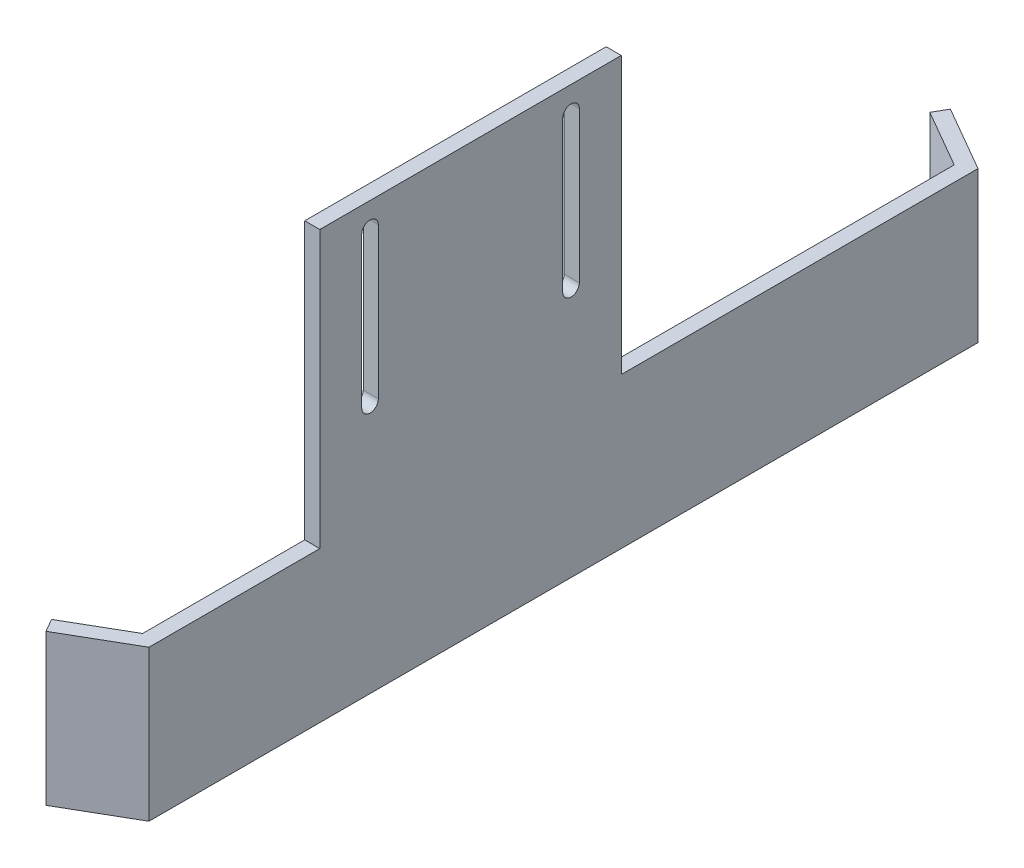
ISO-10303-21;
HEADER;
FILE_DESCRIPTION(('STEP AP214'),'2;1');
FILE_NAME('part.step','',(''),(''),'','','');
FILE_SCHEMA(('AUTOMOTIVE_DESIGN { 1 0 10303 214 1 1 1 1 }'));
ENDSEC;
DATA;
#1=APPLICATION_CONTEXT('core data for automotive mechanical design processes');
#2=APPLICATION_PROTOCOL_DEFINITION('international standard','automotive_design',2000,#1);
#3=PRODUCT_CONTEXT('',#1,'mechanical');
#4=PRODUCT('Part','Part','',(#3));
#5=PRODUCT_RELATED_PRODUCT_CATEGORY('part','',(#4));
#6=PRODUCT_DEFINITION_FORMATION('','',#4);
#7=PRODUCT_DEFINITION_CONTEXT('part definition',#1,'design');
#8=PRODUCT_DEFINITION('design','',#6,#7);
#9=PRODUCT_DEFINITION_SHAPE('','',#8);
#10=(LENGTH_UNIT() NAMED_UNIT(*) SI_UNIT(.MILLI.,.METRE.));
#11=(NAMED_UNIT(*) PLANE_ANGLE_UNIT() SI_UNIT($,.RADIAN.));
#12=(NAMED_UNIT(*) SI_UNIT($,.STERADIAN.) SOLID_ANGLE_UNIT());
#13=UNCERTAINTY_MEASURE_WITH_UNIT(LENGTH_MEASURE(1.E-05),#10,'distance_accuracy_value','');
#14=(GEOMETRIC_REPRESENTATION_CONTEXT(3) GLOBAL_UNCERTAINTY_ASSIGNED_CONTEXT((#13)) GLOBAL_UNIT_ASSIGNED_CONTEXT((#10,
#11,#12)) REPRESENTATION_CONTEXT('',''));
#15=CARTESIAN_POINT('',(0.,0.,0.));
#16=DIRECTION('',(0.,0.,1.));
#17=DIRECTION('',(1.,0.,0.));
#18=AXIS2_PLACEMENT_3D('',#15,#16,#17);
#19=CARTESIAN_POINT('',(82.,0.,0.));
#20=DIRECTION('',(1.,0.,0.));
#21=DIRECTION('',(0.,0.,-1.));
#22=AXIS2_PLACEMENT_3D('',#19,#20,#21);
#23=PLANE('',#22);
#24=DIRECTION('',(0.,-1.,0.));
#25=VECTOR('',#24,1.);
#26=CARTESIAN_POINT('',(82.,-25.,-97.7679491924311));
#27=LINE('',#26,#25);
#28=CARTESIAN_POINT('',(82.,-25.,-97.7679491924311));
#29=VERTEX_POINT('',#28);
#30=CARTESIAN_POINT('',(82.,-55.,-97.7679491924311));
#31=VERTEX_POINT('',#30);
#32=EDGE_CURVE('E263',#29,#31,#27,.T.);
#33=ORIENTED_EDGE('',*,*,#32,.T.);
#34=DIRECTION('',(0.,0.,-1.));
#35=VECTOR('',#34,1.);
#36=CARTESIAN_POINT('',(82.,-55.,65.5));
#37=LINE('',#36,#35);
#38=CARTESIAN_POINT('',(82.,-55.,63.7679491924312));
#39=VERTEX_POINT('',#38);
#40=EDGE_CURVE('E315',#39,#31,#37,.T.);
#41=ORIENTED_EDGE('',*,*,#40,.F.);
#42=DIRECTION('',(0.,-1.,0.));
#43=VECTOR('',#42,1.);
#44=CARTESIAN_POINT('',(82.,-25.,63.7679491924312));
#45=LINE('',#44,#43);
#46=CARTESIAN_POINT('',(82.,-25.,63.7679491924312));
#47=VERTEX_POINT('',#46);
#48=EDGE_CURVE('E285',#47,#39,#45,.T.);
#49=ORIENTED_EDGE('',*,*,#48,.F.);
#50=DIRECTION('',(0.,0.,1.));
#51=VECTOR('',#50,1.);
#52=CARTESIAN_POINT('',(82.,-25.,31.5));
#53=LINE('',#52,#51);
#54=CARTESIAN_POINT('',(82.,-25.,31.5));
#55=VERTEX_POINT('',#54);
#56=EDGE_CURVE('E288',#55,#47,#53,.T.);
#57=ORIENTED_EDGE('',*,*,#56,.F.);
#58=DIRECTION('',(0.,-1.,0.));
#59=VECTOR('',#58,1.);
#60=CARTESIAN_POINT('',(82.,9.99999999999999,31.5));
#61=LINE('',#60,#59);
#62=CARTESIAN_POINT('',(82.,30.,31.5000000000001));
#63=VERTEX_POINT('',#62);
#64=EDGE_CURVE('E307',#63,#55,#61,.T.);
#65=ORIENTED_EDGE('',*,*,#64,.F.);
#66=DIRECTION('',(0.,0.,-1.));
#67=VECTOR('',#66,1.);
#68=CARTESIAN_POINT('',(82.,30.,-28.5));
#69=LINE('',#68,#67);
#70=CARTESIAN_POINT('',(82.,30.,-28.5));
#71=VERTEX_POINT('',#70);
#72=EDGE_CURVE('E204',#63,#71,#69,.T.);
#73=ORIENTED_EDGE('',*,*,#72,.T.);
#74=DIRECTION('',(0.,1.,0.));
#75=VECTOR('',#74,1.);
#76=CARTESIAN_POINT('',(82.,9.99999999999999,-28.5));
#77=LINE('',#76,#75);
#78=CARTESIAN_POINT('',(82.,-25.,-28.5));
#79=VERTEX_POINT('',#78);
#80=EDGE_CURVE('E292',#79,#71,#77,.T.);
#81=ORIENTED_EDGE('',*,*,#80,.F.);
#82=DIRECTION('',(0.,0.,1.));
#83=VECTOR('',#82,1.);
#84=CARTESIAN_POINT('',(82.,-25.,-99.5));
#85=LINE('',#84,#83);
#86=EDGE_CURVE('E294',#29,#79,#85,.T.);
#87=ORIENTED_EDGE('',*,*,#86,.F.);
#88=EDGE_LOOP('',(#33,#41,#49,#57,#65,#73,#81,#87));
#89=FACE_BOUND('',#88,.T.);
#90=DIRECTION('',(0.,1.,0.));
#91=VECTOR('',#90,1.);
#92=CARTESIAN_POINT('',(82.,-5.,23.1500000000001));
#93=LINE('',#92,#91);
#94=CARTESIAN_POINT('',(82.,-5.,23.1500000000001));
#95=VERTEX_POINT('',#94);
#96=CARTESIAN_POINT('',(82.,25.,23.1500000000001));
#97=VERTEX_POINT('',#96);
#98=EDGE_CURVE('E56',#95,#97,#93,.T.);
#99=ORIENTED_EDGE('',*,*,#98,.F.);
#100=CARTESIAN_POINT('',(82.,-5.,21.5000000000001));
#101=DIRECTION('',(-1.,0.,0.));
#102=DIRECTION('',(0.,0.,1.));
#103=AXIS2_PLACEMENT_3D('',#100,#101,#102);
#104=CIRCLE('',#103,1.65);
#105=CARTESIAN_POINT('',(82.,-5.,19.8500000000001));
#106=VERTEX_POINT('',#105);
#107=EDGE_CURVE('E216',#106,#95,#104,.T.);
#108=ORIENTED_EDGE('',*,*,#107,.F.);
#109=DIRECTION('',(0.,-1.,0.));
#110=VECTOR('',#109,1.);
#111=CARTESIAN_POINT('',(82.,-5.,19.8500000000001));
#112=LINE('',#111,#110);
#113=CARTESIAN_POINT('',(82.,25.,19.8500000000001));
#114=VERTEX_POINT('',#113);
#115=EDGE_CURVE('E212',#114,#106,#112,.T.);
#116=ORIENTED_EDGE('',*,*,#115,.F.);
#117=CARTESIAN_POINT('',(82.,25.,21.5000000000001));
#118=DIRECTION('',(-1.,0.,0.));
#119=DIRECTION('',(0.,0.,1.));
#120=AXIS2_PLACEMENT_3D('',#117,#118,#119);
#121=CIRCLE('',#120,1.65);
#122=EDGE_CURVE('E219',#97,#114,#121,.T.);
#123=ORIENTED_EDGE('',*,*,#122,.F.);
#124=EDGE_LOOP('',(#99,#108,#116,#123));
#125=FACE_BOUND('',#124,.T.);
#126=DIRECTION('',(0.,1.,0.));
#127=VECTOR('',#126,1.);
#128=CARTESIAN_POINT('',(82.,-5.,-16.85));
#129=LINE('',#128,#127);
#130=CARTESIAN_POINT('',(82.,-5.,-16.85));
#131=VERTEX_POINT('',#130);
#132=CARTESIAN_POINT('',(82.,25.,-16.85));
#133=VERTEX_POINT('',#132);
#134=EDGE_CURVE('E48',#131,#133,#129,.T.);
#135=ORIENTED_EDGE('',*,*,#134,.F.);
#136=CARTESIAN_POINT('',(82.,-5.,-18.5));
#137=DIRECTION('',(-1.,0.,0.));
#138=DIRECTION('',(0.,0.,1.));
#139=AXIS2_PLACEMENT_3D('',#136,#137,#138);
#140=CIRCLE('',#139,1.65);
#141=CARTESIAN_POINT('',(82.,-5.,-20.15));
#142=VERTEX_POINT('',#141);
#143=EDGE_CURVE('E187',#142,#131,#140,.T.);
#144=ORIENTED_EDGE('',*,*,#143,.F.);
#145=DIRECTION('',(0.,-1.,0.));
#146=VECTOR('',#145,1.);
#147=CARTESIAN_POINT('',(82.,-5.,-20.15));
#148=LINE('',#147,#146);
#149=CARTESIAN_POINT('',(82.,25.,-20.15));
#150=VERTEX_POINT('',#149);
#151=EDGE_CURVE('E191',#150,#142,#148,.T.);
#152=ORIENTED_EDGE('',*,*,#151,.F.);
#153=CARTESIAN_POINT('',(82.,25.,-18.5));
#154=DIRECTION('',(-1.,0.,0.));
#155=DIRECTION('',(0.,0.,1.));
#156=AXIS2_PLACEMENT_3D('',#153,#154,#155);
#157=CIRCLE('',#156,1.65);
#158=EDGE_CURVE('E194',#133,#150,#157,.T.);
#159=ORIENTED_EDGE('',*,*,#158,.F.);
#160=EDGE_LOOP('',(#135,#144,#152,#159));
#161=FACE_BOUND('',#160,.T.);
#162=ADVANCED_FACE('F33',(#89,#125,#161),#23,.F.);
#163=CARTESIAN_POINT('',(85.,0.,3.));
#164=DIRECTION('',(-1.,0.,0.));
#165=DIRECTION('',(0.,0.,1.));
#166=AXIS2_PLACEMENT_3D('',#163,#164,#165);
#167=PLANE('',#166);
#168=CARTESIAN_POINT('',(85.,25.,21.5000000000001));
#169=DIRECTION('',(-1.,0.,0.));
#170=DIRECTION('',(0.,0.,1.));
#171=AXIS2_PLACEMENT_3D('',#168,#169,#170);
#172=CIRCLE('',#171,1.65);
#173=CARTESIAN_POINT('',(85.,25.,23.1500000000001));
#174=VERTEX_POINT('',#173);
#175=CARTESIAN_POINT('',(85.,25.,19.8500000000001));
#176=VERTEX_POINT('',#175);
#177=EDGE_CURVE('E211',#174,#176,#172,.T.);
#178=ORIENTED_EDGE('',*,*,#177,.T.);
#179=DIRECTION('',(0.,-1.,0.));
#180=VECTOR('',#179,1.);
#181=CARTESIAN_POINT('',(85.,0.,19.8500000000001));
#182=LINE('',#181,#180);
#183=CARTESIAN_POINT('',(85.,-5.,19.8500000000001));
#184=VERTEX_POINT('',#183);
#185=EDGE_CURVE('E181',#176,#184,#182,.T.);
#186=ORIENTED_EDGE('',*,*,#185,.T.);
#187=CARTESIAN_POINT('',(85.,-5.,21.5000000000001));
#188=DIRECTION('',(-1.,0.,0.));
#189=DIRECTION('',(0.,0.,1.));
#190=AXIS2_PLACEMENT_3D('',#187,#188,#189);
#191=CIRCLE('',#190,1.65);
#192=CARTESIAN_POINT('',(85.,-5.,23.1500000000001));
#193=VERTEX_POINT('',#192);
#194=EDGE_CURVE('E208',#184,#193,#191,.T.);
#195=ORIENTED_EDGE('',*,*,#194,.T.);
#196=DIRECTION('',(0.,1.,0.));
#197=VECTOR('',#196,1.);
#198=CARTESIAN_POINT('',(85.,0.,23.1500000000001));
#199=LINE('',#198,#197);
#200=EDGE_CURVE('E317',#193,#174,#199,.T.);
#201=ORIENTED_EDGE('',*,*,#200,.T.);
#202=EDGE_LOOP('',(#178,#186,#195,#201));
#203=FACE_BOUND('',#202,.T.);
#204=CARTESIAN_POINT('',(85.,25.,-18.5));
#205=DIRECTION('',(-1.,0.,0.));
#206=DIRECTION('',(0.,0.,1.));
#207=AXIS2_PLACEMENT_3D('',#204,#205,#206);
#208=CIRCLE('',#207,1.65);
#209=CARTESIAN_POINT('',(85.,25.,-16.85));
#210=VERTEX_POINT('',#209);
#211=CARTESIAN_POINT('',(85.,25.,-20.15));
#212=VERTEX_POINT('',#211);
#213=EDGE_CURVE('E188',#210,#212,#208,.T.);
#214=ORIENTED_EDGE('',*,*,#213,.T.);
#215=DIRECTION('',(0.,-1.,0.));
#216=VECTOR('',#215,1.);
#217=CARTESIAN_POINT('',(85.,0.,-20.15));
#218=LINE('',#217,#216);
#219=CARTESIAN_POINT('',(85.,-5.,-20.15));
#220=VERTEX_POINT('',#219);
#221=EDGE_CURVE('E11',#212,#220,#218,.T.);
#222=ORIENTED_EDGE('',*,*,#221,.T.);
#223=CARTESIAN_POINT('',(85.,-5.,-18.5));
#224=DIRECTION('',(-1.,0.,0.));
#225=DIRECTION('',(0.,0.,1.));
#226=AXIS2_PLACEMENT_3D('',#223,#224,#225);
#227=CIRCLE('',#226,1.65);
#228=CARTESIAN_POINT('',(85.,-5.,-16.85));
#229=VERTEX_POINT('',#228);
#230=EDGE_CURVE('E186',#220,#229,#227,.T.);
#231=ORIENTED_EDGE('',*,*,#230,.T.);
#232=DIRECTION('',(0.,1.,0.));
#233=VECTOR('',#232,1.);
#234=CARTESIAN_POINT('',(85.,0.,-16.85));
#235=LINE('',#234,#233);
#236=EDGE_CURVE('E41',#229,#210,#235,.T.);
#237=ORIENTED_EDGE('',*,*,#236,.T.);
#238=EDGE_LOOP('',(#214,#222,#231,#237));
#239=FACE_BOUND('',#238,.T.);
#240=DIRECTION('',(0.,1.,0.));
#241=VECTOR('',#240,1.);
#242=CARTESIAN_POINT('',(85.,10.,-99.5));
#243=LINE('',#242,#241);
#244=CARTESIAN_POINT('',(85.,-55.,-99.5));
#245=VERTEX_POINT('',#244);
#246=CARTESIAN_POINT('',(85.,-25.,-99.5));
#247=VERTEX_POINT('',#246);
#248=EDGE_CURVE('E318',#245,#247,#243,.T.);
#249=ORIENTED_EDGE('',*,*,#248,.T.);
#250=DIRECTION('',(0.,0.,-1.));
#251=VECTOR('',#250,1.);
#252=CARTESIAN_POINT('',(85.,-25.,-99.5));
#253=LINE('',#252,#251);
#254=CARTESIAN_POINT('',(85.,-25.,-28.5));
#255=VERTEX_POINT('',#254);
#256=EDGE_CURVE('E300',#255,#247,#253,.T.);
#257=ORIENTED_EDGE('',*,*,#256,.F.);
#258=DIRECTION('',(0.,-1.,0.));
#259=VECTOR('',#258,1.);
#260=CARTESIAN_POINT('',(85.,9.99999999999999,-28.5));
#261=LINE('',#260,#259);
#262=CARTESIAN_POINT('',(85.,30.,-28.5));
#263=VERTEX_POINT('',#262);
#264=EDGE_CURVE('E297',#263,#255,#261,.T.);
#265=ORIENTED_EDGE('',*,*,#264,.F.);
#266=DIRECTION('',(0.,0.,-1.));
#267=VECTOR('',#266,1.);
#268=CARTESIAN_POINT('',(85.,30.,-28.5));
#269=LINE('',#268,#267);
#270=CARTESIAN_POINT('',(85.,30.,31.5000000000001));
#271=VERTEX_POINT('',#270);
#272=EDGE_CURVE('E232',#271,#263,#269,.T.);
#273=ORIENTED_EDGE('',*,*,#272,.F.);
#274=DIRECTION('',(0.,1.,0.));
#275=VECTOR('',#274,1.);
#276=CARTESIAN_POINT('',(85.,9.99999999999999,31.5));
#277=LINE('',#276,#275);
#278=CARTESIAN_POINT('',(85.,-25.,31.5));
#279=VERTEX_POINT('',#278);
#280=EDGE_CURVE('E309',#279,#271,#277,.T.);
#281=ORIENTED_EDGE('',*,*,#280,.F.);
#282=DIRECTION('',(0.,0.,-1.));
#283=VECTOR('',#282,1.);
#284=CARTESIAN_POINT('',(85.,-25.,31.5));
#285=LINE('',#284,#283);
#286=CARTESIAN_POINT('',(85.,-25.,65.5));
#287=VERTEX_POINT('',#286);
#288=EDGE_CURVE('E311',#287,#279,#285,.T.);
#289=ORIENTED_EDGE('',*,*,#288,.F.);
#290=DIRECTION('',(0.,-1.,0.));
#291=VECTOR('',#290,1.);
#292=CARTESIAN_POINT('',(85.,10.,65.5));
#293=LINE('',#292,#291);
#294=CARTESIAN_POINT('',(85.,-55.,65.5));
#295=VERTEX_POINT('',#294);
#296=EDGE_CURVE('E305',#287,#295,#293,.T.);
#297=ORIENTED_EDGE('',*,*,#296,.T.);
#298=DIRECTION('',(0.,0.,-1.));
#299=VECTOR('',#298,1.);
#300=CARTESIAN_POINT('',(85.,-55.,65.5));
#301=LINE('',#300,#299);
#302=EDGE_CURVE('E321',#295,#245,#301,.T.);
#303=ORIENTED_EDGE('',*,*,#302,.T.);
#304=EDGE_LOOP('',(#249,#257,#265,#273,#281,#289,#297,#303));
#305=FACE_BOUND('',#304,.T.);
#306=ADVANCED_FACE('F35',(#203,#239,#305),#167,.F.);
#307=CARTESIAN_POINT('',(82.,-55.,65.5));
#308=DIRECTION('',(0.,-1.,0.));
#309=DIRECTION('',(0.,0.,-1.));
#310=AXIS2_PLACEMENT_3D('',#307,#308,#309);
#311=PLANE('',#310);
#312=ORIENTED_EDGE('',*,*,#40,.T.);
#313=DIRECTION('',(-0.866025403784436,0.,-0.500000000000004));
#314=VECTOR('',#313,1.);
#315=CARTESIAN_POINT('',(70.5096189432335,-55.,-104.401923788647));
#316=LINE('',#315,#314);
#317=CARTESIAN_POINT('',(70.5096189432335,-55.,-104.401923788647));
#318=VERTEX_POINT('',#317);
#319=EDGE_CURVE('E248',#31,#318,#316,.T.);
#320=ORIENTED_EDGE('',*,*,#319,.T.);
#321=DIRECTION('',(0.499999999999998,0.,-0.866025403784439));
#322=VECTOR('',#321,1.);
#323=CARTESIAN_POINT('',(72.0096189432335,-55.,-107.));
#324=LINE('',#323,#322);
#325=CARTESIAN_POINT('',(72.0096189432335,-55.,-107.));
#326=VERTEX_POINT('',#325);
#327=EDGE_CURVE('E241',#318,#326,#324,.T.);
#328=ORIENTED_EDGE('',*,*,#327,.T.);
#329=DIRECTION('',(0.866025403784436,0.,0.500000000000005));
#330=VECTOR('',#329,1.);
#331=CARTESIAN_POINT('',(85.,-55.,-99.5));
#332=LINE('',#331,#330);
#333=EDGE_CURVE('E256',#326,#245,#332,.T.);
#334=ORIENTED_EDGE('',*,*,#333,.T.);
#335=ORIENTED_EDGE('',*,*,#302,.F.);
#336=DIRECTION('',(-0.866025403784436,0.,0.500000000000004));
#337=VECTOR('',#336,1.);
#338=CARTESIAN_POINT('',(85.,-55.,65.5));
#339=LINE('',#338,#337);
#340=CARTESIAN_POINT('',(72.0096189432335,-55.,73.0000000000001));
#341=VERTEX_POINT('',#340);
#342=EDGE_CURVE('E262',#295,#341,#339,.T.);
#343=ORIENTED_EDGE('',*,*,#342,.T.);
#344=DIRECTION('',(-0.500000000000001,0.,-0.866025403784438));
#345=VECTOR('',#344,1.);
#346=CARTESIAN_POINT('',(72.0096189432335,-55.,73.0000000000001));
#347=LINE('',#346,#345);
#348=CARTESIAN_POINT('',(70.5096189432335,-55.,70.4019237886468));
#349=VERTEX_POINT('',#348);
#350=EDGE_CURVE('E280',#341,#349,#347,.T.);
#351=ORIENTED_EDGE('',*,*,#350,.T.);
#352=DIRECTION('',(0.866025403784436,0.,-0.500000000000004));
#353=VECTOR('',#352,1.);
#354=CARTESIAN_POINT('',(70.5096189432335,-55.,70.4019237886468));
#355=LINE('',#354,#353);
#356=EDGE_CURVE('E271',#349,#39,#355,.T.);
#357=ORIENTED_EDGE('',*,*,#356,.T.);
#358=EDGE_LOOP('',(#312,#320,#328,#334,#335,#343,#351,#357));
#359=FACE_BOUND('',#358,.T.);
#360=ADVANCED_FACE('F359',(#359),#311,.T.);
#361=CARTESIAN_POINT('',(-0.001000000000001,-25.,-99.5));
#362=DIRECTION('',(0.,-1.,0.));
#363=DIRECTION('',(0.,0.,-1.));
#364=AXIS2_PLACEMENT_3D('',#361,#362,#363);
#365=PLANE('',#364);
#366=DIRECTION('',(-0.866025403784436,0.,-0.500000000000004));
#367=VECTOR('',#366,1.);
#368=CARTESIAN_POINT('',(70.5096189432335,-25.,-104.401923788647));
#369=LINE('',#368,#367);
#370=CARTESIAN_POINT('',(70.5096189432335,-25.,-104.401923788647));
#371=VERTEX_POINT('',#370);
#372=EDGE_CURVE('E250',#29,#371,#369,.T.);
#373=ORIENTED_EDGE('',*,*,#372,.F.);
#374=ORIENTED_EDGE('',*,*,#86,.T.);
#375=DIRECTION('',(1.,0.,0.));
#376=VECTOR('',#375,1.);
#377=CARTESIAN_POINT('',(-0.001000000000001,-25.,-28.5));
#378=LINE('',#377,#376);
#379=EDGE_CURVE('E303',#79,#255,#378,.T.);
#380=ORIENTED_EDGE('',*,*,#379,.T.);
#381=ORIENTED_EDGE('',*,*,#256,.T.);
#382=DIRECTION('',(0.866025403784436,0.,0.500000000000005));
#383=VECTOR('',#382,1.);
#384=CARTESIAN_POINT('',(85.,-25.,-99.5));
#385=LINE('',#384,#383);
#386=CARTESIAN_POINT('',(72.0096189432335,-25.,-107.));
#387=VERTEX_POINT('',#386);
#388=EDGE_CURVE('E247',#387,#247,#385,.T.);
#389=ORIENTED_EDGE('',*,*,#388,.F.);
#390=DIRECTION('',(0.499999999999998,0.,-0.866025403784439));
#391=VECTOR('',#390,1.);
#392=CARTESIAN_POINT('',(72.0096189432335,-25.,-107.));
#393=LINE('',#392,#391);
#394=EDGE_CURVE('E244',#371,#387,#393,.T.);
#395=ORIENTED_EDGE('',*,*,#394,.F.);
#396=EDGE_LOOP('',(#373,#374,#380,#381,#389,#395));
#397=FACE_BOUND('',#396,.T.);
#398=ADVANCED_FACE('F364',(#397),#365,.F.);
#399=CARTESIAN_POINT('',(-0.001000000000001,9.99999999999999,-28.5));
#400=DIRECTION('',(0.,0.,1.));
#401=DIRECTION('',(0.,-1.,0.));
#402=AXIS2_PLACEMENT_3D('',#399,#400,#401);
#403=PLANE('',#402);
#404=ORIENTED_EDGE('',*,*,#80,.T.);
#405=DIRECTION('',(-1.,0.,0.));
#406=VECTOR('',#405,1.);
#407=CARTESIAN_POINT('',(85.,30.,-28.5));
#408=LINE('',#407,#406);
#409=EDGE_CURVE('E238',#263,#71,#408,.T.);
#410=ORIENTED_EDGE('',*,*,#409,.F.);
#411=ORIENTED_EDGE('',*,*,#264,.T.);
#412=ORIENTED_EDGE('',*,*,#379,.F.);
#413=EDGE_LOOP('',(#404,#410,#411,#412));
#414=FACE_BOUND('',#413,.T.);
#415=ADVANCED_FACE('F369',(#414),#403,.F.);
#416=CARTESIAN_POINT('',(-0.001000000000001,9.99999999999999,31.5));
#417=DIRECTION('',(0.,0.,-1.));
#418=DIRECTION('',(0.,1.,0.));
#419=AXIS2_PLACEMENT_3D('',#416,#417,#418);
#420=PLANE('',#419);
#421=ORIENTED_EDGE('',*,*,#64,.T.);
#422=DIRECTION('',(1.,0.,0.));
#423=VECTOR('',#422,1.);
#424=CARTESIAN_POINT('',(-0.001000000000001,-25.,31.5));
#425=LINE('',#424,#423);
#426=EDGE_CURVE('E295',#55,#279,#425,.T.);
#427=ORIENTED_EDGE('',*,*,#426,.T.);
#428=ORIENTED_EDGE('',*,*,#280,.T.);
#429=DIRECTION('',(-1.,0.,0.));
#430=VECTOR('',#429,1.);
#431=CARTESIAN_POINT('',(85.,30.,31.5000000000001));
#432=LINE('',#431,#430);
#433=EDGE_CURVE('E235',#271,#63,#432,.T.);
#434=ORIENTED_EDGE('',*,*,#433,.T.);
#435=EDGE_LOOP('',(#421,#427,#428,#434));
#436=FACE_BOUND('',#435,.T.);
#437=ADVANCED_FACE('F361',(#436),#420,.F.);
#438=CARTESIAN_POINT('',(-0.001000000000001,-25.,31.5));
#439=DIRECTION('',(0.,-1.,0.));
#440=DIRECTION('',(0.,0.,-1.));
#441=AXIS2_PLACEMENT_3D('',#438,#439,#440);
#442=PLANE('',#441);
#443=ORIENTED_EDGE('',*,*,#56,.T.);
#444=DIRECTION('',(0.866025403784436,0.,-0.500000000000004));
#445=VECTOR('',#444,1.);
#446=CARTESIAN_POINT('',(70.5096189432335,-25.,70.4019237886468));
#447=LINE('',#446,#445);
#448=CARTESIAN_POINT('',(70.5096189432335,-25.,70.4019237886468));
#449=VERTEX_POINT('',#448);
#450=EDGE_CURVE('E274',#449,#47,#447,.T.);
#451=ORIENTED_EDGE('',*,*,#450,.F.);
#452=DIRECTION('',(-0.500000000000001,0.,-0.866025403784438));
#453=VECTOR('',#452,1.);
#454=CARTESIAN_POINT('',(72.0096189432335,-25.,73.0000000000001));
#455=LINE('',#454,#453);
#456=CARTESIAN_POINT('',(72.0096189432335,-25.,73.0000000000001));
#457=VERTEX_POINT('',#456);
#458=EDGE_CURVE('E270',#457,#449,#455,.T.);
#459=ORIENTED_EDGE('',*,*,#458,.F.);
#460=DIRECTION('',(-0.866025403784436,0.,0.500000000000004));
#461=VECTOR('',#460,1.);
#462=CARTESIAN_POINT('',(85.,-25.,65.5));
#463=LINE('',#462,#461);
#464=EDGE_CURVE('E267',#287,#457,#463,.T.);
#465=ORIENTED_EDGE('',*,*,#464,.F.);
#466=ORIENTED_EDGE('',*,*,#288,.T.);
#467=ORIENTED_EDGE('',*,*,#426,.F.);
#468=EDGE_LOOP('',(#443,#451,#459,#465,#466,#467));
#469=FACE_BOUND('',#468,.T.);
#470=ADVANCED_FACE('F408',(#469),#442,.F.);
#471=CARTESIAN_POINT('',(70.5096189432335,-25.,70.4019237886468));
#472=DIRECTION('',(-0.500000000000004,0.,-0.866025403784436));
#473=DIRECTION('',(-0.866025403784437,0.,0.500000000000004));
#474=AXIS2_PLACEMENT_3D('',#471,#472,#473);
#475=PLANE('',#474);
#476=ORIENTED_EDGE('',*,*,#356,.F.);
#477=DIRECTION('',(0.,-1.,0.));
#478=VECTOR('',#477,1.);
#479=CARTESIAN_POINT('',(70.5096189432335,-25.,70.4019237886468));
#480=LINE('',#479,#478);
#481=EDGE_CURVE('E289',#449,#349,#480,.T.);
#482=ORIENTED_EDGE('',*,*,#481,.F.);
#483=ORIENTED_EDGE('',*,*,#450,.T.);
#484=ORIENTED_EDGE('',*,*,#48,.T.);
#485=EDGE_LOOP('',(#476,#482,#483,#484));
#486=FACE_BOUND('',#485,.T.);
#487=ADVANCED_FACE('F403',(#486),#475,.T.);
#488=CARTESIAN_POINT('',(72.0096189432335,-25.,73.0000000000001));
#489=DIRECTION('',(-0.866025403784438,0.,0.500000000000001));
#490=DIRECTION('',(0.500000000000001,0.,0.866025403784438));
#491=AXIS2_PLACEMENT_3D('',#488,#489,#490);
#492=PLANE('',#491);
#493=ORIENTED_EDGE('',*,*,#350,.F.);
#494=DIRECTION('',(0.,-1.,0.));
#495=VECTOR('',#494,1.);
#496=CARTESIAN_POINT('',(72.0096189432335,-25.,73.0000000000001));
#497=LINE('',#496,#495);
#498=EDGE_CURVE('E277',#457,#341,#497,.T.);
#499=ORIENTED_EDGE('',*,*,#498,.F.);
#500=ORIENTED_EDGE('',*,*,#458,.T.);
#501=ORIENTED_EDGE('',*,*,#481,.T.);
#502=EDGE_LOOP('',(#493,#499,#500,#501));
#503=FACE_BOUND('',#502,.T.);
#504=ADVANCED_FACE('F427',(#503),#492,.T.);
#505=CARTESIAN_POINT('',(85.,-25.,65.5));
#506=DIRECTION('',(0.500000000000004,0.,0.866025403784436));
#507=DIRECTION('',(0.866025403784436,0.,-0.500000000000004));
#508=AXIS2_PLACEMENT_3D('',#505,#506,#507);
#509=PLANE('',#508);
#510=ORIENTED_EDGE('',*,*,#342,.F.);
#511=ORIENTED_EDGE('',*,*,#296,.F.);
#512=ORIENTED_EDGE('',*,*,#464,.T.);
#513=ORIENTED_EDGE('',*,*,#498,.T.);
#514=EDGE_LOOP('',(#510,#511,#512,#513));
#515=FACE_BOUND('',#514,.T.);
#516=ADVANCED_FACE('F399',(#515),#509,.T.);
#517=CARTESIAN_POINT('',(72.0096189432335,-25.,-107.));
#518=DIRECTION('',(-0.866025403784439,0.,-0.499999999999998));
#519=DIRECTION('',(-0.499999999999999,0.,0.86602540378444));
#520=AXIS2_PLACEMENT_3D('',#517,#518,#519);
#521=PLANE('',#520);
#522=ORIENTED_EDGE('',*,*,#327,.F.);
#523=DIRECTION('',(0.,-1.,0.));
#524=VECTOR('',#523,1.);
#525=CARTESIAN_POINT('',(70.5096189432335,-25.,-104.401923788647));
#526=LINE('',#525,#524);
#527=EDGE_CURVE('E260',#371,#318,#526,.T.);
#528=ORIENTED_EDGE('',*,*,#527,.F.);
#529=ORIENTED_EDGE('',*,*,#394,.T.);
#530=DIRECTION('',(0.,-1.,0.));
#531=VECTOR('',#530,1.);
#532=CARTESIAN_POINT('',(72.0096189432335,-25.,-107.));
#533=LINE('',#532,#531);
#534=EDGE_CURVE('E253',#387,#326,#533,.T.);
#535=ORIENTED_EDGE('',*,*,#534,.T.);
#536=EDGE_LOOP('',(#522,#528,#529,#535));
#537=FACE_BOUND('',#536,.T.);
#538=ADVANCED_FACE('F391',(#537),#521,.T.);
#539=CARTESIAN_POINT('',(70.5096189432335,-25.,-104.401923788647));
#540=DIRECTION('',(-0.500000000000004,0.,0.866025403784436));
#541=DIRECTION('',(0.866025403784436,0.,0.500000000000004));
#542=AXIS2_PLACEMENT_3D('',#539,#540,#541);
#543=PLANE('',#542);
#544=ORIENTED_EDGE('',*,*,#319,.F.);
#545=ORIENTED_EDGE('',*,*,#32,.F.);
#546=ORIENTED_EDGE('',*,*,#372,.T.);
#547=ORIENTED_EDGE('',*,*,#527,.T.);
#548=EDGE_LOOP('',(#544,#545,#546,#547));
#549=FACE_BOUND('',#548,.T.);
#550=ADVANCED_FACE('F376',(#549),#543,.T.);
#551=CARTESIAN_POINT('',(85.,-25.,-99.5));
#552=DIRECTION('',(0.500000000000005,0.,-0.866025403784436));
#553=DIRECTION('',(-0.866025403784436,0.,-0.500000000000005));
#554=AXIS2_PLACEMENT_3D('',#551,#552,#553);
#555=PLANE('',#554);
#556=ORIENTED_EDGE('',*,*,#333,.F.);
#557=ORIENTED_EDGE('',*,*,#534,.F.);
#558=ORIENTED_EDGE('',*,*,#388,.T.);
#559=ORIENTED_EDGE('',*,*,#248,.F.);
#560=EDGE_LOOP('',(#556,#557,#558,#559));
#561=FACE_BOUND('',#560,.T.);
#562=ADVANCED_FACE('F393',(#561),#555,.T.);
#563=CARTESIAN_POINT('',(85.,30.,-28.5));
#564=DIRECTION('',(0.,1.,0.));
#565=DIRECTION('',(0.,0.,1.));
#566=AXIS2_PLACEMENT_3D('',#563,#564,#565);
#567=PLANE('',#566);
#568=ORIENTED_EDGE('',*,*,#72,.F.);
#569=ORIENTED_EDGE('',*,*,#433,.F.);
#570=ORIENTED_EDGE('',*,*,#272,.T.);
#571=ORIENTED_EDGE('',*,*,#409,.T.);
#572=EDGE_LOOP('',(#568,#569,#570,#571));
#573=FACE_BOUND('',#572,.T.);
#574=ADVANCED_FACE('F350',(#573),#567,.T.);
#575=CARTESIAN_POINT('',(85.,-5.,19.8500000000001));
#576=DIRECTION('',(0.,0.,-1.));
#577=DIRECTION('',(-1.,0.,0.));
#578=AXIS2_PLACEMENT_3D('',#575,#576,#577);
#579=PLANE('',#578);
#580=ORIENTED_EDGE('',*,*,#185,.F.);
#581=DIRECTION('',(-1.,0.,0.));
#582=VECTOR('',#581,1.);
#583=CARTESIAN_POINT('',(85.,25.,19.8500000000001));
#584=LINE('',#583,#582);
#585=EDGE_CURVE('E225',#176,#114,#584,.T.);
#586=ORIENTED_EDGE('',*,*,#585,.T.);
#587=ORIENTED_EDGE('',*,*,#115,.T.);
#588=DIRECTION('',(-1.,0.,0.));
#589=VECTOR('',#588,1.);
#590=CARTESIAN_POINT('',(85.,-5.,19.8500000000001));
#591=LINE('',#590,#589);
#592=EDGE_CURVE('E198',#184,#106,#591,.T.);
#593=ORIENTED_EDGE('',*,*,#592,.F.);
#594=EDGE_LOOP('',(#580,#586,#587,#593));
#595=FACE_BOUND('',#594,.T.);
#596=ADVANCED_FACE('F333',(#595),#579,.F.);
#597=CARTESIAN_POINT('',(85.,-5.,23.1500000000001));
#598=DIRECTION('',(0.,0.,1.));
#599=DIRECTION('',(1.,0.,0.));
#600=AXIS2_PLACEMENT_3D('',#597,#598,#599);
#601=PLANE('',#600);
#602=ORIENTED_EDGE('',*,*,#200,.F.);
#603=DIRECTION('',(-1.,0.,0.));
#604=VECTOR('',#603,1.);
#605=CARTESIAN_POINT('',(85.,-5.,23.1500000000001));
#606=LINE('',#605,#604);
#607=EDGE_CURVE('E215',#193,#95,#606,.T.);
#608=ORIENTED_EDGE('',*,*,#607,.T.);
#609=ORIENTED_EDGE('',*,*,#98,.T.);
#610=DIRECTION('',(-1.,0.,0.));
#611=VECTOR('',#610,1.);
#612=CARTESIAN_POINT('',(85.,25.,23.1500000000001));
#613=LINE('',#612,#611);
#614=EDGE_CURVE('E227',#174,#97,#613,.T.);
#615=ORIENTED_EDGE('',*,*,#614,.F.);
#616=EDGE_LOOP('',(#602,#608,#609,#615));
#617=FACE_BOUND('',#616,.T.);
#618=ADVANCED_FACE('F342',(#617),#601,.F.);
#619=CARTESIAN_POINT('',(85.,-5.,21.5000000000001));
#620=DIRECTION('',(-1.,0.,0.));
#621=DIRECTION('',(0.,0.,1.));
#622=AXIS2_PLACEMENT_3D('',#619,#620,#621);
#623=CYLINDRICAL_SURFACE('',#622,1.65);
#624=ORIENTED_EDGE('',*,*,#107,.T.);
#625=ORIENTED_EDGE('',*,*,#607,.F.);
#626=ORIENTED_EDGE('',*,*,#194,.F.);
#627=ORIENTED_EDGE('',*,*,#592,.T.);
#628=EDGE_LOOP('',(#624,#625,#626,#627));
#629=FACE_BOUND('',#628,.T.);
#630=ADVANCED_FACE('F339',(#629),#623,.F.);
#631=CARTESIAN_POINT('',(85.,25.,21.5000000000001));
#632=DIRECTION('',(-1.,0.,0.));
#633=DIRECTION('',(0.,0.,1.));
#634=AXIS2_PLACEMENT_3D('',#631,#632,#633);
#635=CYLINDRICAL_SURFACE('',#634,1.65);
#636=ORIENTED_EDGE('',*,*,#122,.T.);
#637=ORIENTED_EDGE('',*,*,#585,.F.);
#638=ORIENTED_EDGE('',*,*,#177,.F.);
#639=ORIENTED_EDGE('',*,*,#614,.T.);
#640=EDGE_LOOP('',(#636,#637,#638,#639));
#641=FACE_BOUND('',#640,.T.);
#642=ADVANCED_FACE('F335',(#641),#635,.F.);
#643=CARTESIAN_POINT('',(85.,-5.,-20.15));
#644=DIRECTION('',(0.,0.,-1.));
#645=DIRECTION('',(-1.,0.,0.));
#646=AXIS2_PLACEMENT_3D('',#643,#644,#645);
#647=PLANE('',#646);
#648=ORIENTED_EDGE('',*,*,#221,.F.);
#649=DIRECTION('',(-1.,0.,0.));
#650=VECTOR('',#649,1.);
#651=CARTESIAN_POINT('',(85.,25.,-20.15));
#652=LINE('',#651,#650);
#653=EDGE_CURVE('E205',#212,#150,#652,.T.);
#654=ORIENTED_EDGE('',*,*,#653,.T.);
#655=ORIENTED_EDGE('',*,*,#151,.T.);
#656=DIRECTION('',(-1.,0.,0.));
#657=VECTOR('',#656,1.);
#658=CARTESIAN_POINT('',(85.,-5.,-20.15));
#659=LINE('',#658,#657);
#660=EDGE_CURVE('E202',#220,#142,#659,.T.);
#661=ORIENTED_EDGE('',*,*,#660,.F.);
#662=EDGE_LOOP('',(#648,#654,#655,#661));
#663=FACE_BOUND('',#662,.T.);
#664=ADVANCED_FACE('F546',(#663),#647,.F.);
#665=CARTESIAN_POINT('',(85.,-5.,-16.85));
#666=DIRECTION('',(0.,0.,1.));
#667=DIRECTION('',(1.,0.,0.));
#668=AXIS2_PLACEMENT_3D('',#665,#666,#667);
#669=PLANE('',#668);
#670=ORIENTED_EDGE('',*,*,#236,.F.);
#671=DIRECTION('',(-1.,0.,0.));
#672=VECTOR('',#671,1.);
#673=CARTESIAN_POINT('',(85.,-5.,-16.85));
#674=LINE('',#673,#672);
#675=EDGE_CURVE('E175',#229,#131,#674,.T.);
#676=ORIENTED_EDGE('',*,*,#675,.T.);
#677=ORIENTED_EDGE('',*,*,#134,.T.);
#678=DIRECTION('',(-1.,0.,0.));
#679=VECTOR('',#678,1.);
#680=CARTESIAN_POINT('',(85.,25.,-16.85));
#681=LINE('',#680,#679);
#682=EDGE_CURVE('E177',#210,#133,#681,.T.);
#683=ORIENTED_EDGE('',*,*,#682,.F.);
#684=EDGE_LOOP('',(#670,#676,#677,#683));
#685=FACE_BOUND('',#684,.T.);
#686=ADVANCED_FACE('F174',(#685),#669,.F.);
#687=CARTESIAN_POINT('',(85.,-5.,-18.5));
#688=DIRECTION('',(-1.,0.,0.));
#689=DIRECTION('',(0.,0.,1.));
#690=AXIS2_PLACEMENT_3D('',#687,#688,#689);
#691=CYLINDRICAL_SURFACE('',#690,1.65);
#692=ORIENTED_EDGE('',*,*,#143,.T.);
#693=ORIENTED_EDGE('',*,*,#675,.F.);
#694=ORIENTED_EDGE('',*,*,#230,.F.);
#695=ORIENTED_EDGE('',*,*,#660,.T.);
#696=EDGE_LOOP('',(#692,#693,#694,#695));
#697=FACE_BOUND('',#696,.T.);
#698=ADVANCED_FACE('F184',(#697),#691,.F.);
#699=CARTESIAN_POINT('',(85.,25.,-18.5));
#700=DIRECTION('',(-1.,0.,0.));
#701=DIRECTION('',(0.,0.,1.));
#702=AXIS2_PLACEMENT_3D('',#699,#700,#701);
#703=CYLINDRICAL_SURFACE('',#702,1.65);
#704=ORIENTED_EDGE('',*,*,#158,.T.);
#705=ORIENTED_EDGE('',*,*,#653,.F.);
#706=ORIENTED_EDGE('',*,*,#213,.F.);
#707=ORIENTED_EDGE('',*,*,#682,.T.);
#708=EDGE_LOOP('',(#704,#705,#706,#707));
#709=FACE_BOUND('',#708,.T.);
#710=ADVANCED_FACE('F568',(#709),#703,.F.);
#711=CLOSED_SHELL('',(#162,#306,#360,#398,#415,#437,#470,#487,#504,#516,#538,#550,#562,#574,
#596,#618,#630,#642,#664,#686,#698,#710));
#712=MANIFOLD_SOLID_BREP('B2',#711);
#713=ADVANCED_BREP_SHAPE_REPRESENTATION('',(#18,#712),#14);
#714=SHAPE_DEFINITION_REPRESENTATION(#9,#713);
ENDSEC;
END-ISO-10303-21;
